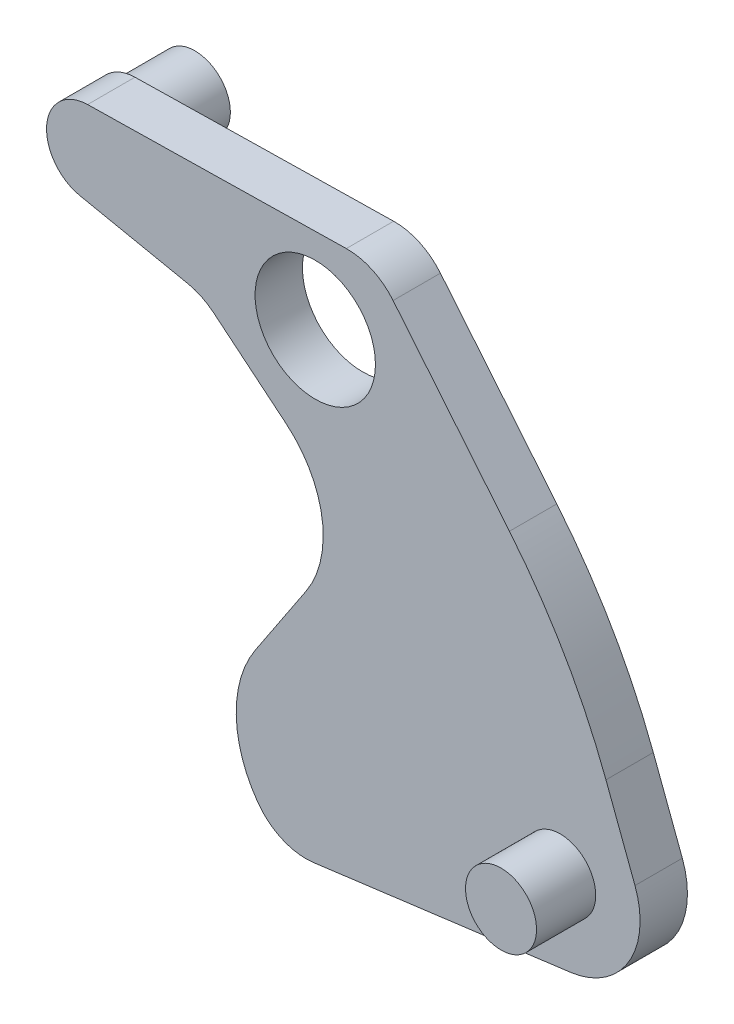
ISO-10303-21;
HEADER;
FILE_DESCRIPTION(('STEP AP214'),'2;1');
FILE_NAME('part.step','',(''),(''),'','','');
FILE_SCHEMA(('AUTOMOTIVE_DESIGN { 1 0 10303 214 1 1 1 1 }'));
ENDSEC;
DATA;
#1=APPLICATION_CONTEXT('core data for automotive mechanical design processes');
#2=APPLICATION_PROTOCOL_DEFINITION('international standard','automotive_design',2000,#1);
#3=PRODUCT_CONTEXT('',#1,'mechanical');
#4=PRODUCT('Part','Part','',(#3));
#5=PRODUCT_RELATED_PRODUCT_CATEGORY('part','',(#4));
#6=PRODUCT_DEFINITION_FORMATION('','',#4);
#7=PRODUCT_DEFINITION_CONTEXT('part definition',#1,'design');
#8=PRODUCT_DEFINITION('design','',#6,#7);
#9=PRODUCT_DEFINITION_SHAPE('','',#8);
#10=(LENGTH_UNIT() NAMED_UNIT(*) SI_UNIT(.MILLI.,.METRE.));
#11=(NAMED_UNIT(*) PLANE_ANGLE_UNIT() SI_UNIT($,.RADIAN.));
#12=(NAMED_UNIT(*) SI_UNIT($,.STERADIAN.) SOLID_ANGLE_UNIT());
#13=UNCERTAINTY_MEASURE_WITH_UNIT(LENGTH_MEASURE(1.E-05),#10,'distance_accuracy_value','');
#14=(GEOMETRIC_REPRESENTATION_CONTEXT(3) GLOBAL_UNCERTAINTY_ASSIGNED_CONTEXT((#13)) GLOBAL_UNIT_ASSIGNED_CONTEXT((#10,
#11,#12)) REPRESENTATION_CONTEXT('',''));
#15=CARTESIAN_POINT('',(0.,0.,0.));
#16=DIRECTION('',(0.,0.,1.));
#17=DIRECTION('',(1.,0.,0.));
#18=AXIS2_PLACEMENT_3D('',#15,#16,#17);
#19=CARTESIAN_POINT('',(-1.9172681653691,0.33281698460314,0.4));
#20=DIRECTION('',(0.,0.,-1.));
#21=DIRECTION('',(-1.,0.,0.));
#22=AXIS2_PLACEMENT_3D('',#19,#20,#21);
#23=CYLINDRICAL_SURFACE('',#22,0.353401554158885);
#24=CARTESIAN_POINT('',(-1.9172681653691,0.33281698460314,0.));
#25=DIRECTION('',(0.,0.,-1.));
#26=DIRECTION('',(-1.,0.,0.));
#27=AXIS2_PLACEMENT_3D('',#24,#25,#26);
#28=CIRCLE('',#27,0.353401554158885);
#29=CARTESIAN_POINT('',(-1.98838203465784,-0.0133556256315521,0.));
#30=VERTEX_POINT('',#29);
#31=CARTESIAN_POINT('',(-1.9235743801696,0.686162269185806,0.));
#32=VERTEX_POINT('',#31);
#33=EDGE_CURVE('E187',#30,#32,#28,.T.);
#34=ORIENTED_EDGE('',*,*,#33,.F.);
#35=DIRECTION('',(0.,0.,-1.));
#36=VECTOR('',#35,1.);
#37=CARTESIAN_POINT('',(-1.98838203465784,-0.0133556256315521,0.4));
#38=LINE('',#37,#36);
#39=CARTESIAN_POINT('',(-1.98838203465784,-0.0133556256315521,0.4));
#40=VERTEX_POINT('',#39);
#41=EDGE_CURVE('E164',#40,#30,#38,.T.);
#42=ORIENTED_EDGE('',*,*,#41,.F.);
#43=CARTESIAN_POINT('',(-1.9172681653691,0.33281698460314,0.4));
#44=DIRECTION('',(0.,0.,-1.));
#45=DIRECTION('',(-1.,0.,0.));
#46=AXIS2_PLACEMENT_3D('',#43,#44,#45);
#47=CIRCLE('',#46,0.353401554158885);
#48=CARTESIAN_POINT('',(-1.9235743801696,0.686162269185806,0.4));
#49=VERTEX_POINT('',#48);
#50=EDGE_CURVE('E156',#40,#49,#47,.T.);
#51=ORIENTED_EDGE('',*,*,#50,.T.);
#52=DIRECTION('',(0.,0.,-1.));
#53=VECTOR('',#52,1.);
#54=CARTESIAN_POINT('',(-1.9235743801696,0.686162269185806,0.4));
#55=LINE('',#54,#53);
#56=EDGE_CURVE('E137',#49,#32,#55,.T.);
#57=ORIENTED_EDGE('',*,*,#56,.T.);
#58=EDGE_LOOP('',(#34,#42,#51,#57));
#59=FACE_BOUND('',#58,.T.);
#60=ADVANCED_FACE('F32',(#59),#23,.T.);
#61=CARTESIAN_POINT('',(-0.955537124319622,-0.225531851530912,0.4));
#62=DIRECTION('',(-0.201226815365851,-0.979544674212319,0.));
#63=DIRECTION('',(0.979544674212319,-0.201226815365851,0.));
#64=AXIS2_PLACEMENT_3D('',#61,#62,#63);
#65=PLANE('',#64);
#66=DIRECTION('',(-0.979544674212319,0.201226815365851,0.));
#67=VECTOR('',#66,1.);
#68=CARTESIAN_POINT('',(-0.955537124319622,-0.225531851530912,0.));
#69=LINE('',#68,#67);
#70=CARTESIAN_POINT('',(-1.07712368077318,-0.200554455205294,0.));
#71=VERTEX_POINT('',#70);
#72=EDGE_CURVE('E165',#71,#30,#69,.T.);
#73=ORIENTED_EDGE('',*,*,#72,.F.);
#74=DIRECTION('',(0.,0.,-1.));
#75=VECTOR('',#74,1.);
#76=CARTESIAN_POINT('',(-1.07712368077318,-0.200554455205294,0.4));
#77=LINE('',#76,#75);
#78=CARTESIAN_POINT('',(-1.07712368077318,-0.200554455205294,0.4));
#79=VERTEX_POINT('',#78);
#80=EDGE_CURVE('E233',#71,#79,#77,.F.);
#81=ORIENTED_EDGE('',*,*,#80,.T.);
#82=DIRECTION('',(-0.979544674212319,0.201226815365851,0.));
#83=VECTOR('',#82,1.);
#84=CARTESIAN_POINT('',(-0.955537124319622,-0.225531851530912,0.4));
#85=LINE('',#84,#83);
#86=EDGE_CURVE('E150',#79,#40,#85,.T.);
#87=ORIENTED_EDGE('',*,*,#86,.T.);
#88=ORIENTED_EDGE('',*,*,#41,.T.);
#89=EDGE_LOOP('',(#73,#81,#87,#88));
#90=FACE_BOUND('',#89,.T.);
#91=ADVANCED_FACE('F280',(#90),#65,.T.);
#92=CARTESIAN_POINT('',(0.352902823598166,-1.30383910192083,0.4));
#93=DIRECTION('',(-0.635977287447087,-0.771707774906697,0.));
#94=DIRECTION('',(0.771707774906697,-0.635977287447087,0.));
#95=AXIS2_PLACEMENT_3D('',#92,#93,#94);
#96=PLANE('',#95);
#97=DIRECTION('',(-0.771707774906697,0.635977287447087,0.));
#98=VECTOR('',#97,1.);
#99=CARTESIAN_POINT('',(0.352902823598166,-1.30383910192083,0.));
#100=LINE('',#99,#98);
#101=CARTESIAN_POINT('',(-0.246466248489008,-0.809889022576656,0.));
#102=VERTEX_POINT('',#101);
#103=CARTESIAN_POINT('',(-0.859748444732557,-0.304472904858105,0.));
#104=VERTEX_POINT('',#103);
#105=EDGE_CURVE('E167',#102,#104,#100,.T.);
#106=ORIENTED_EDGE('',*,*,#105,.F.);
#107=DIRECTION('',(0.,0.,-1.));
#108=VECTOR('',#107,1.);
#109=CARTESIAN_POINT('',(-0.246466248489008,-0.809889022576656,0.4));
#110=LINE('',#109,#108);
#111=CARTESIAN_POINT('',(-0.246466248489008,-0.809889022576656,0.4));
#112=VERTEX_POINT('',#111);
#113=EDGE_CURVE('E253',#102,#112,#110,.F.);
#114=ORIENTED_EDGE('',*,*,#113,.T.);
#115=DIRECTION('',(-0.771707774906697,0.635977287447087,0.));
#116=VECTOR('',#115,1.);
#117=CARTESIAN_POINT('',(0.352902823598166,-1.30383910192083,0.4));
#118=LINE('',#117,#116);
#119=CARTESIAN_POINT('',(-0.859748444732557,-0.304472904858105,0.4));
#120=VERTEX_POINT('',#119);
#121=EDGE_CURVE('E184',#112,#120,#118,.T.);
#122=ORIENTED_EDGE('',*,*,#121,.T.);
#123=DIRECTION('',(0.,0.,-1.));
#124=VECTOR('',#123,1.);
#125=CARTESIAN_POINT('',(-0.859748444732557,-0.304472904858105,0.));
#126=LINE('',#125,#124);
#127=EDGE_CURVE('E230',#120,#104,#126,.T.);
#128=ORIENTED_EDGE('',*,*,#127,.T.);
#129=EDGE_LOOP('',(#106,#114,#122,#128));
#130=FACE_BOUND('',#129,.T.);
#131=ADVANCED_FACE('F285',(#130),#96,.T.);
#132=CARTESIAN_POINT('',(-0.505487079801069,-2.59582951628516,0.4));
#133=DIRECTION('',(-0.832923164956253,0.55338865300913,0.));
#134=DIRECTION('',(-0.55338865300913,-0.832923164956253,0.));
#135=AXIS2_PLACEMENT_3D('',#132,#133,#134);
#136=PLANE('',#135);
#137=DIRECTION('',(0.55338865300913,0.832923164956253,0.));
#138=VECTOR('',#137,1.);
#139=CARTESIAN_POINT('',(-0.505487079801069,-2.59582951628516,0.4));
#140=LINE('',#139,#138);
#141=CARTESIAN_POINT('',(-0.505487079801069,-2.59582951628516,0.4));
#142=VERTEX_POINT('',#141);
#143=CARTESIAN_POINT('',(-0.0769024138801726,-1.9507528699726,0.4));
#144=VERTEX_POINT('',#143);
#145=EDGE_CURVE('E181',#142,#144,#140,.T.);
#146=ORIENTED_EDGE('',*,*,#145,.T.);
#147=DIRECTION('',(0.,0.,-1.));
#148=VECTOR('',#147,1.);
#149=CARTESIAN_POINT('',(-0.0769024138801726,-1.9507528699726,0.));
#150=LINE('',#149,#148);
#151=CARTESIAN_POINT('',(-0.0769024138801726,-1.9507528699726,0.));
#152=VERTEX_POINT('',#151);
#153=EDGE_CURVE('E250',#144,#152,#150,.T.);
#154=ORIENTED_EDGE('',*,*,#153,.T.);
#155=DIRECTION('',(0.55338865300913,0.832923164956253,0.));
#156=VECTOR('',#155,1.);
#157=CARTESIAN_POINT('',(-0.505487079801069,-2.59582951628516,0.));
#158=LINE('',#157,#156);
#159=CARTESIAN_POINT('',(-0.505487079801069,-2.59582951628516,0.));
#160=VERTEX_POINT('',#159);
#161=EDGE_CURVE('E198',#160,#152,#158,.T.);
#162=ORIENTED_EDGE('',*,*,#161,.F.);
#163=DIRECTION('',(0.,0.,-1.));
#164=VECTOR('',#163,1.);
#165=CARTESIAN_POINT('',(-0.505487079801069,-2.59582951628516,0.4));
#166=LINE('',#165,#164);
#167=EDGE_CURVE('E149',#142,#160,#166,.T.);
#168=ORIENTED_EDGE('',*,*,#167,.F.);
#169=EDGE_LOOP('',(#146,#154,#162,#168));
#170=FACE_BOUND('',#169,.T.);
#171=ADVANCED_FACE('F328',(#170),#136,.T.);
#172=CARTESIAN_POINT('',(0.304270084154294,-3.13382683113867,0.4));
#173=DIRECTION('',(0.,0.,-1.));
#174=DIRECTION('',(-1.,0.,0.));
#175=AXIS2_PLACEMENT_3D('',#172,#173,#174);
#176=CYLINDRICAL_SURFACE('',#175,0.972187109237013);
#177=CARTESIAN_POINT('',(0.304270084154294,-3.13382683113867,0.));
#178=DIRECTION('',(0.,0.,-1.));
#179=DIRECTION('',(-1.,0.,0.));
#180=AXIS2_PLACEMENT_3D('',#177,#178,#179);
#181=CIRCLE('',#180,0.972187109237013);
#182=CARTESIAN_POINT('',(-0.483572635672984,-3.70343338322684,0.));
#183=VERTEX_POINT('',#182);
#184=EDGE_CURVE('E196',#183,#160,#181,.T.);
#185=ORIENTED_EDGE('',*,*,#184,.F.);
#186=DIRECTION('',(0.,0.,-1.));
#187=VECTOR('',#186,1.);
#188=CARTESIAN_POINT('',(-0.483572635672984,-3.70343338322684,0.4));
#189=LINE('',#188,#187);
#190=CARTESIAN_POINT('',(-0.483572635672984,-3.70343338322684,0.4));
#191=VERTEX_POINT('',#190);
#192=EDGE_CURVE('E228',#183,#191,#189,.F.);
#193=ORIENTED_EDGE('',*,*,#192,.T.);
#194=CARTESIAN_POINT('',(0.304270084154294,-3.13382683113867,0.4));
#195=DIRECTION('',(0.,0.,-1.));
#196=DIRECTION('',(-1.,0.,0.));
#197=AXIS2_PLACEMENT_3D('',#194,#195,#196);
#198=CIRCLE('',#197,0.972187109237013);
#199=EDGE_CURVE('E179',#191,#142,#198,.T.);
#200=ORIENTED_EDGE('',*,*,#199,.T.);
#201=ORIENTED_EDGE('',*,*,#167,.T.);
#202=EDGE_LOOP('',(#185,#193,#200,#201));
#203=FACE_BOUND('',#202,.T.);
#204=ADVANCED_FACE('F321',(#203),#176,.T.);
#205=CARTESIAN_POINT('',(3.00197209314096,-3.51395935523573,0.4));
#206=DIRECTION('',(0.129007135206592,-0.991643665368659,0.));
#207=DIRECTION('',(0.991643665368659,0.129007135206592,0.));
#208=AXIS2_PLACEMENT_3D('',#205,#206,#207);
#209=PLANE('',#208);
#210=DIRECTION('',(-0.991643665368658,-0.129007135206592,0.));
#211=VECTOR('',#210,1.);
#212=CARTESIAN_POINT('',(3.00197209314096,-3.51395935523573,0.));
#213=LINE('',#212,#211);
#214=CARTESIAN_POINT('',(2.15687052013641,-3.62390220739056,0.));
#215=VERTEX_POINT('',#214);
#216=CARTESIAN_POINT('',(-0.0138781781978867,-3.90630412312451,0.));
#217=VERTEX_POINT('',#216);
#218=EDGE_CURVE('E194',#215,#217,#213,.T.);
#219=ORIENTED_EDGE('',*,*,#218,.F.);
#220=DIRECTION('',(0.,0.,-1.));
#221=VECTOR('',#220,1.);
#222=CARTESIAN_POINT('',(2.15687052013641,-3.62390220739056,0.4));
#223=LINE('',#222,#221);
#224=CARTESIAN_POINT('',(2.15687052013641,-3.62390220739056,0.4));
#225=VERTEX_POINT('',#224);
#226=EDGE_CURVE('E245',#215,#225,#223,.F.);
#227=ORIENTED_EDGE('',*,*,#226,.T.);
#228=DIRECTION('',(-0.991643665368658,-0.129007135206592,0.));
#229=VECTOR('',#228,1.);
#230=CARTESIAN_POINT('',(3.00197209314096,-3.51395935523573,0.4));
#231=LINE('',#230,#229);
#232=CARTESIAN_POINT('',(-0.0138781781978867,-3.90630412312451,0.4));
#233=VERTEX_POINT('',#232);
#234=EDGE_CURVE('E177',#225,#233,#231,.T.);
#235=ORIENTED_EDGE('',*,*,#234,.T.);
#236=DIRECTION('',(0.,0.,-1.));
#237=VECTOR('',#236,1.);
#238=CARTESIAN_POINT('',(-0.0138781781978872,-3.90630412312451,0.4));
#239=LINE('',#238,#237);
#240=EDGE_CURVE('E225',#233,#217,#239,.T.);
#241=ORIENTED_EDGE('',*,*,#240,.T.);
#242=EDGE_LOOP('',(#219,#227,#235,#241));
#243=FACE_BOUND('',#242,.T.);
#244=ADVANCED_FACE('F316',(#243),#209,.T.);
#245=CARTESIAN_POINT('',(2.1651596810603,-1.29247397204099,0.4));
#246=DIRECTION('',(0.935808050036026,0.352509990621217,0.));
#247=DIRECTION('',(-0.352509990621217,0.935808050036026,0.));
#248=AXIS2_PLACEMENT_3D('',#245,#246,#247);
#249=PLANE('',#248);
#250=DIRECTION('',(0.352509990621217,-0.935808050036026,0.));
#251=VECTOR('',#250,1.);
#252=CARTESIAN_POINT('',(2.1651596810603,-1.29247397204099,0.));
#253=LINE('',#252,#251);
#254=CARTESIAN_POINT('',(2.45634098721407,-2.06547280205571,0.));
#255=VERTEX_POINT('',#254);
#256=CARTESIAN_POINT('',(2.7015549594692,-2.71644217972717,0.));
#257=VERTEX_POINT('',#256);
#258=EDGE_CURVE('E192',#255,#257,#253,.T.);
#259=ORIENTED_EDGE('',*,*,#258,.F.);
#260=DIRECTION('',(0.,0.,-1.));
#261=VECTOR('',#260,1.);
#262=CARTESIAN_POINT('',(2.45634098721407,-2.06547280205571,0.4));
#263=LINE('',#262,#261);
#264=CARTESIAN_POINT('',(2.45634098721407,-2.06547280205571,0.4));
#265=VERTEX_POINT('',#264);
#266=EDGE_CURVE('E40',#255,#265,#263,.F.);
#267=ORIENTED_EDGE('',*,*,#266,.T.);
#268=DIRECTION('',(0.352509990621217,-0.935808050036026,0.));
#269=VECTOR('',#268,1.);
#270=CARTESIAN_POINT('',(2.1651596810603,-1.29247397204099,0.4));
#271=LINE('',#270,#269);
#272=CARTESIAN_POINT('',(2.7015549594692,-2.71644217972717,0.4));
#273=VERTEX_POINT('',#272);
#274=EDGE_CURVE('E175',#265,#273,#271,.T.);
#275=ORIENTED_EDGE('',*,*,#274,.T.);
#276=DIRECTION('',(0.,0.,-1.));
#277=VECTOR('',#276,1.);
#278=CARTESIAN_POINT('',(2.7015549594692,-2.71644217972717,0.4));
#279=LINE('',#278,#277);
#280=EDGE_CURVE('E240',#273,#257,#279,.T.);
#281=ORIENTED_EDGE('',*,*,#280,.T.);
#282=EDGE_LOOP('',(#259,#267,#275,#281));
#283=FACE_BOUND('',#282,.T.);
#284=ADVANCED_FACE('F350',(#283),#249,.T.);
#285=CARTESIAN_POINT('',(0.504151468497281,0.729490314999379,0.4));
#286=DIRECTION('',(0.772705827537591,0.634764290181361,0.));
#287=DIRECTION('',(-0.634764290181361,0.772705827537591,0.));
#288=AXIS2_PLACEMENT_3D('',#285,#286,#287);
#289=PLANE('',#288);
#290=DIRECTION('',(0.634764290181361,-0.772705827537591,0.));
#291=VECTOR('',#290,1.);
#292=CARTESIAN_POINT('',(0.504151468497281,0.729490314999379,0.4));
#293=LINE('',#292,#291);
#294=CARTESIAN_POINT('',(0.657648181901328,0.542637010883473,0.4));
#295=VERTEX_POINT('',#294);
#296=CARTESIAN_POINT('',(1.64082987472189,-0.65420130425499,0.4));
#297=VERTEX_POINT('',#296);
#298=EDGE_CURVE('E160',#295,#297,#293,.T.);
#299=ORIENTED_EDGE('',*,*,#298,.T.);
#300=DIRECTION('',(0.,0.,-1.));
#301=VECTOR('',#300,1.);
#302=CARTESIAN_POINT('',(1.64082987472189,-0.65420130425499,0.4));
#303=LINE('',#302,#301);
#304=CARTESIAN_POINT('',(1.64082987472189,-0.65420130425499,0.));
#305=VERTEX_POINT('',#304);
#306=EDGE_CURVE('E259',#297,#305,#303,.T.);
#307=ORIENTED_EDGE('',*,*,#306,.T.);
#308=DIRECTION('',(0.634764290181361,-0.772705827537591,0.));
#309=VECTOR('',#308,1.);
#310=CARTESIAN_POINT('',(0.504151468497281,0.729490314999379,0.));
#311=LINE('',#310,#309);
#312=CARTESIAN_POINT('',(0.657648181901328,0.542637010883473,0.));
#313=VERTEX_POINT('',#312);
#314=EDGE_CURVE('E190',#313,#305,#311,.T.);
#315=ORIENTED_EDGE('',*,*,#314,.F.);
#316=DIRECTION('',(0.,0.,-1.));
#317=VECTOR('',#316,1.);
#318=CARTESIAN_POINT('',(0.657648181901328,0.542637010883473,0.4));
#319=LINE('',#318,#317);
#320=EDGE_CURVE('E219',#313,#295,#319,.F.);
#321=ORIENTED_EDGE('',*,*,#320,.T.);
#322=EDGE_LOOP('',(#299,#307,#315,#321));
#323=FACE_BOUND('',#322,.T.);
#324=ADVANCED_FACE('F265',(#323),#289,.T.);
#325=CARTESIAN_POINT('',(-1.9235743801696,0.686162269185806,0.4));
#326=DIRECTION('',(-0.0178443323926636,0.999840777224784,0.));
#327=DIRECTION('',(-0.999840777224784,-0.0178443323926636,0.));
#328=AXIS2_PLACEMENT_3D('',#325,#326,#327);
#329=PLANE('',#328);
#330=DIRECTION('',(0.999840777224784,0.0178443323926636,0.));
#331=VECTOR('',#330,1.);
#332=CARTESIAN_POINT('',(-1.9235743801696,0.686162269185806,0.4));
#333=LINE('',#332,#331);
#334=CARTESIAN_POINT('',(0.262373101936201,0.725175254405184,0.4));
#335=VERTEX_POINT('',#334);
#336=EDGE_CURVE('E141',#49,#335,#333,.T.);
#337=ORIENTED_EDGE('',*,*,#336,.T.);
#338=DIRECTION('',(0.,0.,-1.));
#339=VECTOR('',#338,1.);
#340=CARTESIAN_POINT('',(0.262373101936201,0.725175254405184,0.4));
#341=LINE('',#340,#339);
#342=CARTESIAN_POINT('',(0.262373101936201,0.725175254405184,0.));
#343=VERTEX_POINT('',#342);
#344=EDGE_CURVE('E208',#335,#343,#341,.T.);
#345=ORIENTED_EDGE('',*,*,#344,.T.);
#346=DIRECTION('',(0.999840777224784,0.0178443323926636,0.));
#347=VECTOR('',#346,1.);
#348=CARTESIAN_POINT('',(-1.9235743801696,0.686162269185806,0.));
#349=LINE('',#348,#347);
#350=EDGE_CURVE('E144',#32,#343,#349,.T.);
#351=ORIENTED_EDGE('',*,*,#350,.F.);
#352=ORIENTED_EDGE('',*,*,#56,.F.);
#353=EDGE_LOOP('',(#337,#345,#351,#352));
#354=FACE_BOUND('',#353,.T.);
#355=ADVANCED_FACE('F139',(#354),#329,.T.);
#356=CARTESIAN_POINT('',(-1.9172681653691,0.33281698460314,0.4));
#357=DIRECTION('',(0.,0.,-1.));
#358=DIRECTION('',(-1.,0.,0.));
#359=AXIS2_PLACEMENT_3D('',#356,#357,#358);
#360=PLANE('',#359);
#361=CARTESIAN_POINT('',(0.,0.,0.400000000000001));
#362=DIRECTION('',(0.,0.,1.));
#363=DIRECTION('',(1.,0.,0.));
#364=AXIS2_PLACEMENT_3D('',#361,#362,#363);
#365=CIRCLE('',#364,0.508507199804513);
#366=CARTESIAN_POINT('',(0.508507199804513,0.,0.400000000000001));
#367=VERTEX_POINT('',#366);
#368=EDGE_CURVE('E213',#367,#367,#365,.T.);
#369=ORIENTED_EDGE('',*,*,#368,.F.);
#370=EDGE_LOOP('',(#369));
#371=FACE_BOUND('',#370,.T.);
#372=CARTESIAN_POINT('',(2.06977570180098,-2.95442741632214,0.4));
#373=DIRECTION('',(0.,0.,-1.));
#374=DIRECTION('',(-1.,0.,0.));
#375=AXIS2_PLACEMENT_3D('',#372,#373,#374);
#376=CIRCLE('',#375,0.300000000000001);
#377=CARTESIAN_POINT('',(1.76977570180098,-2.95442741632214,0.4));
#378=VERTEX_POINT('',#377);
#379=EDGE_CURVE('E394',#378,#378,#376,.T.);
#380=ORIENTED_EDGE('',*,*,#379,.T.);
#381=EDGE_LOOP('',(#380));
#382=FACE_BOUND('',#381,.T.);
#383=ORIENTED_EDGE('',*,*,#274,.F.);
#384=CARTESIAN_POINT('',(-2.22269926296606,-3.8280227551618,0.4));
#385=DIRECTION('',(0.,0.,-1.));
#386=DIRECTION('',(-1.,0.,0.));
#387=AXIS2_PLACEMENT_3D('',#384,#385,#386);
#388=CIRCLE('',#387,5.);
#389=EDGE_CURVE('E11',#265,#297,#388,.F.);
#390=ORIENTED_EDGE('',*,*,#389,.T.);
#391=ORIENTED_EDGE('',*,*,#298,.F.);
#392=CARTESIAN_POINT('',(0.271295268132532,0.225254865792793,0.4));
#393=DIRECTION('',(0.,0.,-1.));
#394=DIRECTION('',(-1.,0.,0.));
#395=AXIS2_PLACEMENT_3D('',#392,#393,#394);
#396=CIRCLE('',#395,0.5);
#397=EDGE_CURVE('E159',#295,#335,#396,.F.);
#398=ORIENTED_EDGE('',*,*,#397,.T.);
#399=ORIENTED_EDGE('',*,*,#336,.F.);
#400=ORIENTED_EDGE('',*,*,#50,.F.);
#401=ORIENTED_EDGE('',*,*,#86,.F.);
#402=CARTESIAN_POINT('',(-1.1777370884561,-0.690326792311454,0.4));
#403=DIRECTION('',(0.,0.,-1.));
#404=DIRECTION('',(-1.,0.,0.));
#405=AXIS2_PLACEMENT_3D('',#402,#403,#404);
#406=CIRCLE('',#405,0.5);
#407=EDGE_CURVE('E237',#79,#120,#406,.T.);
#408=ORIENTED_EDGE('',*,*,#407,.T.);
#409=ORIENTED_EDGE('',*,*,#121,.F.);
#410=CARTESIAN_POINT('',(-0.794021490302255,-1.47430368900978,0.4));
#411=DIRECTION('',(0.,0.,-1.));
#412=DIRECTION('',(-1.,0.,0.));
#413=AXIS2_PLACEMENT_3D('',#410,#411,#412);
#414=CIRCLE('',#413,0.860966661264305);
#415=EDGE_CURVE('E257',#112,#144,#414,.T.);
#416=ORIENTED_EDGE('',*,*,#415,.T.);
#417=ORIENTED_EDGE('',*,*,#145,.F.);
#418=ORIENTED_EDGE('',*,*,#199,.F.);
#419=CARTESIAN_POINT('',(-0.0783817458011832,-3.41048229044018,0.4));
#420=DIRECTION('',(0.,0.,-1.));
#421=DIRECTION('',(-1.,0.,0.));
#422=AXIS2_PLACEMENT_3D('',#419,#420,#421);
#423=CIRCLE('',#422,0.5);
#424=EDGE_CURVE('E221',#191,#233,#423,.F.);
#425=ORIENTED_EDGE('',*,*,#424,.T.);
#426=ORIENTED_EDGE('',*,*,#234,.F.);
#427=CARTESIAN_POINT('',(2.06977570180098,-2.95442741632214,0.4));
#428=DIRECTION('',(0.,0.,-1.));
#429=DIRECTION('',(-1.,0.,0.));
#430=AXIS2_PLACEMENT_3D('',#427,#428,#429);
#431=CIRCLE('',#430,0.675116288691792);
#432=EDGE_CURVE('E247',#225,#273,#431,.F.);
#433=ORIENTED_EDGE('',*,*,#432,.T.);
#434=EDGE_LOOP('',(#383,#390,#391,#398,#399,#400,#401,#408,#409,#416,#417,#418,#425,#426,#433));
#435=FACE_BOUND('',#434,.T.);
#436=ADVANCED_FACE('F154',(#371,#382,#435),#360,.F.);
#437=CARTESIAN_POINT('',(-1.9172681653691,0.33281698460314,0.));
#438=DIRECTION('',(0.,0.,-1.));
#439=DIRECTION('',(-1.,0.,0.));
#440=AXIS2_PLACEMENT_3D('',#437,#438,#439);
#441=PLANE('',#440);
#442=CARTESIAN_POINT('',(0.,0.,0.));
#443=DIRECTION('',(0.,0.,-1.));
#444=DIRECTION('',(-1.,0.,0.));
#445=AXIS2_PLACEMENT_3D('',#442,#443,#444);
#446=CIRCLE('',#445,0.508507199804513);
#447=CARTESIAN_POINT('',(-0.508507199804513,0.,0.));
#448=VERTEX_POINT('',#447);
#449=EDGE_CURVE('E209',#448,#448,#446,.T.);
#450=ORIENTED_EDGE('',*,*,#449,.F.);
#451=EDGE_LOOP('',(#450));
#452=FACE_BOUND('',#451,.T.);
#453=CARTESIAN_POINT('',(-1.9172681653691,0.33281698460314,0.));
#454=DIRECTION('',(0.,0.,-1.));
#455=DIRECTION('',(-1.,0.,0.));
#456=AXIS2_PLACEMENT_3D('',#453,#454,#455);
#457=CIRCLE('',#456,0.3);
#458=CARTESIAN_POINT('',(-2.21726816536911,0.33281698460314,0.));
#459=VERTEX_POINT('',#458);
#460=EDGE_CURVE('E203',#459,#459,#457,.T.);
#461=ORIENTED_EDGE('',*,*,#460,.F.);
#462=EDGE_LOOP('',(#461));
#463=FACE_BOUND('',#462,.T.);
#464=ORIENTED_EDGE('',*,*,#314,.T.);
#465=CARTESIAN_POINT('',(-2.22269926296606,-3.8280227551618,0.));
#466=DIRECTION('',(0.,0.,-1.));
#467=DIRECTION('',(-1.,0.,0.));
#468=AXIS2_PLACEMENT_3D('',#465,#466,#467);
#469=CIRCLE('',#468,5.);
#470=EDGE_CURVE('E54',#305,#255,#469,.T.);
#471=ORIENTED_EDGE('',*,*,#470,.T.);
#472=ORIENTED_EDGE('',*,*,#258,.T.);
#473=CARTESIAN_POINT('',(2.06977570180098,-2.95442741632214,0.));
#474=DIRECTION('',(0.,0.,-1.));
#475=DIRECTION('',(-1.,0.,0.));
#476=AXIS2_PLACEMENT_3D('',#473,#474,#475);
#477=CIRCLE('',#476,0.675116288691792);
#478=EDGE_CURVE('E243',#257,#215,#477,.T.);
#479=ORIENTED_EDGE('',*,*,#478,.T.);
#480=ORIENTED_EDGE('',*,*,#218,.T.);
#481=CARTESIAN_POINT('',(-0.0783817458011832,-3.41048229044018,0.));
#482=DIRECTION('',(0.,0.,-1.));
#483=DIRECTION('',(-1.,0.,0.));
#484=AXIS2_PLACEMENT_3D('',#481,#482,#483);
#485=CIRCLE('',#484,0.5);
#486=EDGE_CURVE('E215',#217,#183,#485,.T.);
#487=ORIENTED_EDGE('',*,*,#486,.T.);
#488=ORIENTED_EDGE('',*,*,#184,.T.);
#489=ORIENTED_EDGE('',*,*,#161,.T.);
#490=CARTESIAN_POINT('',(-0.794021490302255,-1.47430368900978,0.));
#491=DIRECTION('',(0.,0.,-1.));
#492=DIRECTION('',(-1.,0.,0.));
#493=AXIS2_PLACEMENT_3D('',#490,#491,#492);
#494=CIRCLE('',#493,0.860966661264305);
#495=EDGE_CURVE('E255',#152,#102,#494,.F.);
#496=ORIENTED_EDGE('',*,*,#495,.T.);
#497=ORIENTED_EDGE('',*,*,#105,.T.);
#498=CARTESIAN_POINT('',(-1.1777370884561,-0.690326792311454,0.));
#499=DIRECTION('',(0.,0.,-1.));
#500=DIRECTION('',(-1.,0.,0.));
#501=AXIS2_PLACEMENT_3D('',#498,#499,#500);
#502=CIRCLE('',#501,0.5);
#503=EDGE_CURVE('E235',#104,#71,#502,.F.);
#504=ORIENTED_EDGE('',*,*,#503,.T.);
#505=ORIENTED_EDGE('',*,*,#72,.T.);
#506=ORIENTED_EDGE('',*,*,#33,.T.);
#507=ORIENTED_EDGE('',*,*,#350,.T.);
#508=CARTESIAN_POINT('',(0.271295268132532,0.225254865792793,0.));
#509=DIRECTION('',(0.,0.,-1.));
#510=DIRECTION('',(-1.,0.,0.));
#511=AXIS2_PLACEMENT_3D('',#508,#509,#510);
#512=CIRCLE('',#511,0.5);
#513=EDGE_CURVE('E217',#343,#313,#512,.T.);
#514=ORIENTED_EDGE('',*,*,#513,.T.);
#515=EDGE_LOOP('',(#464,#471,#472,#479,#480,#487,#488,#489,#496,#497,#504,#505,#506,#507,#514));
#516=FACE_BOUND('',#515,.T.);
#517=ADVANCED_FACE('F269',(#452,#463,#516),#441,.T.);
#518=CARTESIAN_POINT('',(2.06977570180098,-2.95442741632214,0.9));
#519=DIRECTION('',(0.,0.,-1.));
#520=DIRECTION('',(-1.,0.,0.));
#521=AXIS2_PLACEMENT_3D('',#518,#519,#520);
#522=CYLINDRICAL_SURFACE('',#521,0.3);
#523=CARTESIAN_POINT('',(2.06977570180098,-2.95442741632214,0.9));
#524=DIRECTION('',(0.,0.,-1.));
#525=DIRECTION('',(-1.,0.,0.));
#526=AXIS2_PLACEMENT_3D('',#523,#524,#525);
#527=CIRCLE('',#526,0.3);
#528=CARTESIAN_POINT('',(1.76977570180098,-2.95442741632214,0.9));
#529=VERTEX_POINT('',#528);
#530=EDGE_CURVE('E170',#529,#529,#527,.T.);
#531=ORIENTED_EDGE('',*,*,#530,.T.);
#532=EDGE_LOOP('',(#531));
#533=FACE_BOUND('',#532,.T.);
#534=ORIENTED_EDGE('',*,*,#379,.F.);
#535=EDGE_LOOP('',(#534));
#536=FACE_BOUND('',#535,.T.);
#537=ADVANCED_FACE('F364',(#533,#536),#522,.T.);
#538=CARTESIAN_POINT('',(2.36977570180098,-2.95442741632214,0.9));
#539=DIRECTION('',(0.,0.,1.));
#540=DIRECTION('',(1.,0.,0.));
#541=AXIS2_PLACEMENT_3D('',#538,#539,#540);
#542=PLANE('',#541);
#543=ORIENTED_EDGE('',*,*,#530,.F.);
#544=EDGE_LOOP('',(#543));
#545=FACE_BOUND('',#544,.T.);
#546=ADVANCED_FACE('F371',(#545),#542,.T.);
#547=CARTESIAN_POINT('',(-1.9172681653691,0.33281698460314,-0.5));
#548=DIRECTION('',(0.,0.,1.));
#549=DIRECTION('',(1.,0.,0.));
#550=AXIS2_PLACEMENT_3D('',#547,#548,#549);
#551=CYLINDRICAL_SURFACE('',#550,0.3);
#552=CARTESIAN_POINT('',(-1.9172681653691,0.33281698460314,-0.5));
#553=DIRECTION('',(0.,0.,1.));
#554=DIRECTION('',(1.,0.,0.));
#555=AXIS2_PLACEMENT_3D('',#552,#553,#554);
#556=CIRCLE('',#555,0.3);
#557=CARTESIAN_POINT('',(-1.6172681653691,0.33281698460314,-0.5));
#558=VERTEX_POINT('',#557);
#559=EDGE_CURVE('E212',#558,#558,#556,.T.);
#560=ORIENTED_EDGE('',*,*,#559,.T.);
#561=EDGE_LOOP('',(#560));
#562=FACE_BOUND('',#561,.T.);
#563=ORIENTED_EDGE('',*,*,#460,.T.);
#564=EDGE_LOOP('',(#563));
#565=FACE_BOUND('',#564,.T.);
#566=ADVANCED_FACE('F375',(#562,#565),#551,.T.);
#567=CARTESIAN_POINT('',(-1.6172681653691,0.33281698460314,-0.5));
#568=DIRECTION('',(0.,0.,-1.));
#569=DIRECTION('',(-1.,0.,0.));
#570=AXIS2_PLACEMENT_3D('',#567,#568,#569);
#571=PLANE('',#570);
#572=ORIENTED_EDGE('',*,*,#559,.F.);
#573=EDGE_LOOP('',(#572));
#574=FACE_BOUND('',#573,.T.);
#575=ADVANCED_FACE('F379',(#574),#571,.T.);
#576=CARTESIAN_POINT('',(0.,0.,0.4));
#577=DIRECTION('',(0.,0.,1.));
#578=DIRECTION('',(1.,0.,0.));
#579=AXIS2_PLACEMENT_3D('',#576,#577,#578);
#580=CYLINDRICAL_SURFACE('',#579,0.508507199804513);
#581=ORIENTED_EDGE('',*,*,#449,.T.);
#582=EDGE_LOOP('',(#581));
#583=FACE_BOUND('',#582,.T.);
#584=ORIENTED_EDGE('',*,*,#368,.T.);
#585=EDGE_LOOP('',(#584));
#586=FACE_BOUND('',#585,.T.);
#587=ADVANCED_FACE('F294',(#583,#586),#580,.F.);
#588=CARTESIAN_POINT('',(0.271295268132532,0.225254865792793,0.4));
#589=DIRECTION('',(0.,0.,-1.));
#590=DIRECTION('',(-1.,0.,0.));
#591=AXIS2_PLACEMENT_3D('',#588,#589,#590);
#592=CYLINDRICAL_SURFACE('',#591,0.5);
#593=ORIENTED_EDGE('',*,*,#397,.F.);
#594=ORIENTED_EDGE('',*,*,#320,.F.);
#595=ORIENTED_EDGE('',*,*,#513,.F.);
#596=ORIENTED_EDGE('',*,*,#344,.F.);
#597=EDGE_LOOP('',(#593,#594,#595,#596));
#598=FACE_BOUND('',#597,.T.);
#599=ADVANCED_FACE('F271',(#598),#592,.T.);
#600=CARTESIAN_POINT('',(-0.0783817458011832,-3.41048229044018,0.4));
#601=DIRECTION('',(0.,0.,-1.));
#602=DIRECTION('',(-1.,0.,0.));
#603=AXIS2_PLACEMENT_3D('',#600,#601,#602);
#604=CYLINDRICAL_SURFACE('',#603,0.5);
#605=ORIENTED_EDGE('',*,*,#424,.F.);
#606=ORIENTED_EDGE('',*,*,#192,.F.);
#607=ORIENTED_EDGE('',*,*,#486,.F.);
#608=ORIENTED_EDGE('',*,*,#240,.F.);
#609=EDGE_LOOP('',(#605,#606,#607,#608));
#610=FACE_BOUND('',#609,.T.);
#611=ADVANCED_FACE('F293',(#610),#604,.T.);
#612=CARTESIAN_POINT('',(-1.1777370884561,-0.690326792311454,0.4));
#613=DIRECTION('',(0.,0.,1.));
#614=DIRECTION('',(1.,0.,0.));
#615=AXIS2_PLACEMENT_3D('',#612,#613,#614);
#616=CYLINDRICAL_SURFACE('',#615,0.5);
#617=ORIENTED_EDGE('',*,*,#407,.F.);
#618=ORIENTED_EDGE('',*,*,#80,.F.);
#619=ORIENTED_EDGE('',*,*,#503,.F.);
#620=ORIENTED_EDGE('',*,*,#127,.F.);
#621=EDGE_LOOP('',(#617,#618,#619,#620));
#622=FACE_BOUND('',#621,.T.);
#623=ADVANCED_FACE('F297',(#622),#616,.F.);
#624=CARTESIAN_POINT('',(2.06977570180098,-2.95442741632214,0.4));
#625=DIRECTION('',(0.,0.,-1.));
#626=DIRECTION('',(-1.,0.,0.));
#627=AXIS2_PLACEMENT_3D('',#624,#625,#626);
#628=CYLINDRICAL_SURFACE('',#627,0.675116288691792);
#629=ORIENTED_EDGE('',*,*,#432,.F.);
#630=ORIENTED_EDGE('',*,*,#226,.F.);
#631=ORIENTED_EDGE('',*,*,#478,.F.);
#632=ORIENTED_EDGE('',*,*,#280,.F.);
#633=EDGE_LOOP('',(#629,#630,#631,#632));
#634=FACE_BOUND('',#633,.T.);
#635=ADVANCED_FACE('F277',(#634),#628,.T.);
#636=CARTESIAN_POINT('',(-0.794021490302255,-1.47430368900978,0.4));
#637=DIRECTION('',(0.,0.,1.));
#638=DIRECTION('',(1.,0.,0.));
#639=AXIS2_PLACEMENT_3D('',#636,#637,#638);
#640=CYLINDRICAL_SURFACE('',#639,0.860966661264305);
#641=ORIENTED_EDGE('',*,*,#415,.F.);
#642=ORIENTED_EDGE('',*,*,#113,.F.);
#643=ORIENTED_EDGE('',*,*,#495,.F.);
#644=ORIENTED_EDGE('',*,*,#153,.F.);
#645=EDGE_LOOP('',(#641,#642,#643,#644));
#646=FACE_BOUND('',#645,.T.);
#647=ADVANCED_FACE('F273',(#646),#640,.F.);
#648=CARTESIAN_POINT('',(-2.22269926296606,-3.8280227551618,0.4));
#649=DIRECTION('',(0.,0.,-1.));
#650=DIRECTION('',(-1.,0.,0.));
#651=AXIS2_PLACEMENT_3D('',#648,#649,#650);
#652=CYLINDRICAL_SURFACE('',#651,5.);
#653=ORIENTED_EDGE('',*,*,#389,.F.);
#654=ORIENTED_EDGE('',*,*,#266,.F.);
#655=ORIENTED_EDGE('',*,*,#470,.F.);
#656=ORIENTED_EDGE('',*,*,#306,.F.);
#657=EDGE_LOOP('',(#653,#654,#655,#656));
#658=FACE_BOUND('',#657,.T.);
#659=ADVANCED_FACE('F34',(#658),#652,.T.);
#660=CLOSED_SHELL('',(#60,#91,#131,#171,#204,#244,#284,#324,#355,#436,#517,#537,#546,#566,#575,
#587,#599,#611,#623,#635,#647,#659));
#661=MANIFOLD_SOLID_BREP('B2',#660);
#662=ADVANCED_BREP_SHAPE_REPRESENTATION('',(#18,#661),#14);
#663=SHAPE_DEFINITION_REPRESENTATION(#9,#662);
ENDSEC;
END-ISO-10303-21;
